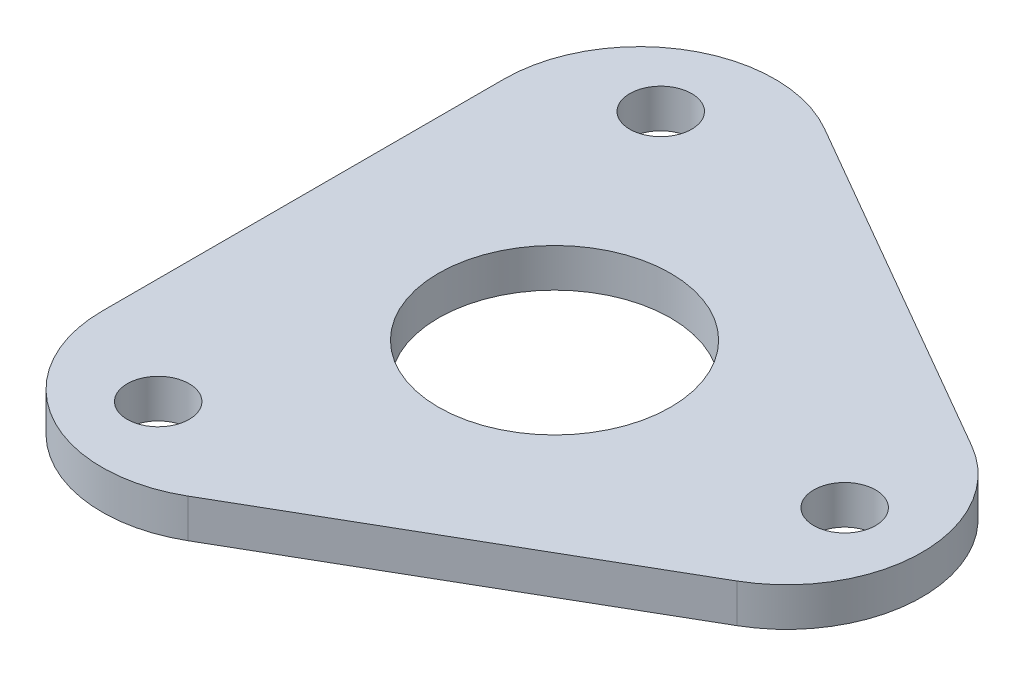
ISO-10303-21;
HEADER;
FILE_DESCRIPTION(('STEP AP214'),'2;1');
FILE_NAME('part.step','',(''),(''),'','','');
FILE_SCHEMA(('AUTOMOTIVE_DESIGN { 1 0 10303 214 1 1 1 1 }'));
ENDSEC;
DATA;
#1=APPLICATION_CONTEXT('core data for automotive mechanical design processes');
#2=APPLICATION_PROTOCOL_DEFINITION('international standard','automotive_design',2000,#1);
#3=PRODUCT_CONTEXT('',#1,'mechanical');
#4=PRODUCT('Part','Part','',(#3));
#5=PRODUCT_RELATED_PRODUCT_CATEGORY('part','',(#4));
#6=PRODUCT_DEFINITION_FORMATION('','',#4);
#7=PRODUCT_DEFINITION_CONTEXT('part definition',#1,'design');
#8=PRODUCT_DEFINITION('design','',#6,#7);
#9=PRODUCT_DEFINITION_SHAPE('','',#8);
#10=(LENGTH_UNIT() NAMED_UNIT(*) SI_UNIT(.MILLI.,.METRE.));
#11=(NAMED_UNIT(*) PLANE_ANGLE_UNIT() SI_UNIT($,.RADIAN.));
#12=(NAMED_UNIT(*) SI_UNIT($,.STERADIAN.) SOLID_ANGLE_UNIT());
#13=UNCERTAINTY_MEASURE_WITH_UNIT(LENGTH_MEASURE(1.E-05),#10,'distance_accuracy_value','');
#14=(GEOMETRIC_REPRESENTATION_CONTEXT(3) GLOBAL_UNCERTAINTY_ASSIGNED_CONTEXT((#13)) GLOBAL_UNIT_ASSIGNED_CONTEXT((#10,
#11,#12)) REPRESENTATION_CONTEXT('',''));
#15=CARTESIAN_POINT('',(0.,0.,0.));
#16=DIRECTION('',(0.,0.,1.));
#17=DIRECTION('',(1.,0.,0.));
#18=AXIS2_PLACEMENT_3D('',#15,#16,#17);
#19=CARTESIAN_POINT('',(0.,2.00000000000006,0.));
#20=DIRECTION('',(0.,1.,0.));
#21=DIRECTION('',(0.,0.,1.));
#22=AXIS2_PLACEMENT_3D('',#19,#20,#21);
#23=PLANE('',#22);
#24=CARTESIAN_POINT('',(15.0000000000004,2.00000000000006,-6.28837260041593E-13));
#25=DIRECTION('',(0.,1.,0.));
#26=DIRECTION('',(0.,0.,1.));
#27=AXIS2_PLACEMENT_3D('',#24,#25,#26);
#28=CIRCLE('',#27,1.60000000000077);
#29=CARTESIAN_POINT('',(15.0000000000004,2.00000000000006,1.60000000000014));
#30=VERTEX_POINT('',#29);
#31=EDGE_CURVE('E158',#30,#30,#28,.T.);
#32=ORIENTED_EDGE('',*,*,#31,.F.);
#33=EDGE_LOOP('',(#32));
#34=FACE_BOUND('',#33,.T.);
#35=CARTESIAN_POINT('',(-7.5,2.00000000000006,-12.9903810567666));
#36=DIRECTION('',(0.,1.,0.));
#37=DIRECTION('',(0.,0.,1.));
#38=AXIS2_PLACEMENT_3D('',#35,#36,#37);
#39=CIRCLE('',#38,1.6);
#40=CARTESIAN_POINT('',(-7.5,2.00000000000006,-11.3903810567666));
#41=VERTEX_POINT('',#40);
#42=EDGE_CURVE('E146',#41,#41,#39,.T.);
#43=ORIENTED_EDGE('',*,*,#42,.F.);
#44=EDGE_LOOP('',(#43));
#45=FACE_BOUND('',#44,.T.);
#46=DIRECTION('',(-0.86602540378444,0.,-0.499999999999998));
#47=VECTOR('',#46,1.);
#48=CARTESIAN_POINT('',(26.,2.00000000000006,0.));
#49=LINE('',#48,#47);
#50=CARTESIAN_POINT('',(15.5,2.00000000000006,-6.06217782649103));
#51=VERTEX_POINT('',#50);
#52=CARTESIAN_POINT('',(-2.50000000000003,2.00000000000006,-16.4544826719043));
#53=VERTEX_POINT('',#52);
#54=EDGE_CURVE('E121',#51,#53,#49,.T.);
#55=ORIENTED_EDGE('',*,*,#54,.T.);
#56=CARTESIAN_POINT('',(-6.00000000000002,2.00000000000006,-10.3923048454132));
#57=DIRECTION('',(0.,1.,0.));
#58=DIRECTION('',(0.,0.,1.));
#59=AXIS2_PLACEMENT_3D('',#56,#57,#58);
#60=CIRCLE('',#59,7.);
#61=CARTESIAN_POINT('',(-13.,2.00000000000006,-10.3923048454131));
#62=VERTEX_POINT('',#61);
#63=EDGE_CURVE('E136',#53,#62,#60,.T.);
#64=ORIENTED_EDGE('',*,*,#63,.T.);
#65=DIRECTION('',(0.,0.,1.));
#66=VECTOR('',#65,1.);
#67=CARTESIAN_POINT('',(-13.0000000000001,2.,-22.5166604983953));
#68=LINE('',#67,#66);
#69=CARTESIAN_POINT('',(-12.9999999999999,2.00000000000006,10.3923048454134));
#70=VERTEX_POINT('',#69);
#71=EDGE_CURVE('E111',#62,#70,#68,.T.);
#72=ORIENTED_EDGE('',*,*,#71,.T.);
#73=CARTESIAN_POINT('',(-5.99999999999987,2.,10.3923048454134));
#74=DIRECTION('',(0.,1.,0.));
#75=DIRECTION('',(0.,0.,1.));
#76=AXIS2_PLACEMENT_3D('',#73,#74,#75);
#77=CIRCLE('',#76,7.);
#78=CARTESIAN_POINT('',(-2.49999999999985,2.,16.4544826719044));
#79=VERTEX_POINT('',#78);
#80=EDGE_CURVE('E59',#70,#79,#77,.T.);
#81=ORIENTED_EDGE('',*,*,#80,.T.);
#82=DIRECTION('',(0.866025403784437,0.,-0.500000000000004));
#83=VECTOR('',#82,1.);
#84=CARTESIAN_POINT('',(-12.9999999999998,2.,22.5166604983955));
#85=LINE('',#84,#83);
#86=CARTESIAN_POINT('',(15.5000000000001,2.00000000000006,6.06217782649111));
#87=VERTEX_POINT('',#86);
#88=EDGE_CURVE('E118',#79,#87,#85,.T.);
#89=ORIENTED_EDGE('',*,*,#88,.T.);
#90=CARTESIAN_POINT('',(12.,2.,0.));
#91=DIRECTION('',(0.,1.,0.));
#92=DIRECTION('',(0.,0.,1.));
#93=AXIS2_PLACEMENT_3D('',#90,#91,#92);
#94=CIRCLE('',#93,7.);
#95=EDGE_CURVE('E133',#87,#51,#94,.T.);
#96=ORIENTED_EDGE('',*,*,#95,.T.);
#97=EDGE_LOOP('',(#55,#64,#72,#81,#89,#96));
#98=FACE_BOUND('',#97,.T.);
#99=CARTESIAN_POINT('',(0.,2.00000000000006,0.));
#100=DIRECTION('',(0.,1.,0.));
#101=DIRECTION('',(0.,0.,1.));
#102=AXIS2_PLACEMENT_3D('',#99,#100,#101);
#103=CIRCLE('',#102,6.);
#104=CARTESIAN_POINT('',(0.,2.00000000000006,6.));
#105=VERTEX_POINT('',#104);
#106=EDGE_CURVE('E153',#105,#105,#103,.T.);
#107=ORIENTED_EDGE('',*,*,#106,.F.);
#108=EDGE_LOOP('',(#107));
#109=FACE_BOUND('',#108,.T.);
#110=CARTESIAN_POINT('',(-7.49999999999927,2.,12.9903810567666));
#111=DIRECTION('',(0.,1.,0.));
#112=DIRECTION('',(0.,0.,1.));
#113=AXIS2_PLACEMENT_3D('',#110,#111,#112);
#114=CIRCLE('',#113,1.60000000000068);
#115=CARTESIAN_POINT('',(-7.49999999999927,2.,14.5903810567673));
#116=VERTEX_POINT('',#115);
#117=EDGE_CURVE('E164',#116,#116,#114,.T.);
#118=ORIENTED_EDGE('',*,*,#117,.F.);
#119=EDGE_LOOP('',(#118));
#120=FACE_BOUND('',#119,.T.);
#121=ADVANCED_FACE('F38',(#34,#45,#98,#109,#120),#23,.T.);
#122=CARTESIAN_POINT('',(0.,0.,0.));
#123=DIRECTION('',(0.,1.,0.));
#124=DIRECTION('',(0.,0.,1.));
#125=AXIS2_PLACEMENT_3D('',#122,#123,#124);
#126=PLANE('',#125);
#127=DIRECTION('',(0.,0.,1.));
#128=VECTOR('',#127,1.);
#129=CARTESIAN_POINT('',(-13.0000000000001,0.,-22.5166604983953));
#130=LINE('',#129,#128);
#131=CARTESIAN_POINT('',(-13.,0.,-10.3923048454131));
#132=VERTEX_POINT('',#131);
#133=CARTESIAN_POINT('',(-12.9999999999999,0.,10.3923048454134));
#134=VERTEX_POINT('',#133);
#135=EDGE_CURVE('E109',#132,#134,#130,.T.);
#136=ORIENTED_EDGE('',*,*,#135,.F.);
#137=CARTESIAN_POINT('',(-6.00000000000002,0.,-10.3923048454132));
#138=DIRECTION('',(0.,1.,0.));
#139=DIRECTION('',(0.,0.,1.));
#140=AXIS2_PLACEMENT_3D('',#137,#138,#139);
#141=CIRCLE('',#140,7.);
#142=CARTESIAN_POINT('',(-2.50000000000003,0.,-16.4544826719043));
#143=VERTEX_POINT('',#142);
#144=EDGE_CURVE('E92',#132,#143,#141,.F.);
#145=ORIENTED_EDGE('',*,*,#144,.T.);
#146=DIRECTION('',(-0.86602540378444,0.,-0.499999999999998));
#147=VECTOR('',#146,1.);
#148=CARTESIAN_POINT('',(26.,0.,0.));
#149=LINE('',#148,#147);
#150=CARTESIAN_POINT('',(15.5,0.,-6.06217782649103));
#151=VERTEX_POINT('',#150);
#152=EDGE_CURVE('E119',#151,#143,#149,.T.);
#153=ORIENTED_EDGE('',*,*,#152,.F.);
#154=CARTESIAN_POINT('',(12.,0.,0.));
#155=DIRECTION('',(0.,1.,0.));
#156=DIRECTION('',(0.,0.,1.));
#157=AXIS2_PLACEMENT_3D('',#154,#155,#156);
#158=CIRCLE('',#157,7.);
#159=CARTESIAN_POINT('',(15.5000000000001,0.,6.0621778264911));
#160=VERTEX_POINT('',#159);
#161=EDGE_CURVE('E112',#151,#160,#158,.F.);
#162=ORIENTED_EDGE('',*,*,#161,.T.);
#163=DIRECTION('',(0.866025403784437,0.,-0.500000000000004));
#164=VECTOR('',#163,1.);
#165=CARTESIAN_POINT('',(-12.9999999999998,0.,22.5166604983955));
#166=LINE('',#165,#164);
#167=CARTESIAN_POINT('',(-2.49999999999985,0.,16.4544826719044));
#168=VERTEX_POINT('',#167);
#169=EDGE_CURVE('E123',#168,#160,#166,.T.);
#170=ORIENTED_EDGE('',*,*,#169,.F.);
#171=CARTESIAN_POINT('',(-5.99999999999987,0.,10.3923048454134));
#172=DIRECTION('',(0.,1.,0.));
#173=DIRECTION('',(0.,0.,1.));
#174=AXIS2_PLACEMENT_3D('',#171,#172,#173);
#175=CIRCLE('',#174,7.);
#176=EDGE_CURVE('E103',#168,#134,#175,.F.);
#177=ORIENTED_EDGE('',*,*,#176,.T.);
#178=EDGE_LOOP('',(#136,#145,#153,#162,#170,#177));
#179=FACE_BOUND('',#178,.T.);
#180=CARTESIAN_POINT('',(-7.5,0.,-12.9903810567666));
#181=DIRECTION('',(0.,1.,0.));
#182=DIRECTION('',(0.,0.,1.));
#183=AXIS2_PLACEMENT_3D('',#180,#181,#182);
#184=CIRCLE('',#183,1.6);
#185=CARTESIAN_POINT('',(-7.5,0.,-11.3903810567666));
#186=VERTEX_POINT('',#185);
#187=EDGE_CURVE('E148',#186,#186,#184,.T.);
#188=ORIENTED_EDGE('',*,*,#187,.T.);
#189=EDGE_LOOP('',(#188));
#190=FACE_BOUND('',#189,.T.);
#191=CARTESIAN_POINT('',(0.,0.,0.));
#192=DIRECTION('',(0.,1.,0.));
#193=DIRECTION('',(0.,0.,1.));
#194=AXIS2_PLACEMENT_3D('',#191,#192,#193);
#195=CIRCLE('',#194,6.);
#196=CARTESIAN_POINT('',(0.,0.,6.));
#197=VERTEX_POINT('',#196);
#198=EDGE_CURVE('E155',#197,#197,#195,.T.);
#199=ORIENTED_EDGE('',*,*,#198,.T.);
#200=EDGE_LOOP('',(#199));
#201=FACE_BOUND('',#200,.T.);
#202=CARTESIAN_POINT('',(15.0000000000004,0.,-6.27969898303604E-13));
#203=DIRECTION('',(0.,1.,0.));
#204=DIRECTION('',(0.,0.,1.));
#205=AXIS2_PLACEMENT_3D('',#202,#203,#204);
#206=CIRCLE('',#205,1.60000000000077);
#207=CARTESIAN_POINT('',(15.0000000000004,0.,1.60000000000014));
#208=VERTEX_POINT('',#207);
#209=EDGE_CURVE('E161',#208,#208,#206,.T.);
#210=ORIENTED_EDGE('',*,*,#209,.T.);
#211=EDGE_LOOP('',(#210));
#212=FACE_BOUND('',#211,.T.);
#213=CARTESIAN_POINT('',(-7.49999999999927,0.,12.9903810567666));
#214=DIRECTION('',(0.,1.,0.));
#215=DIRECTION('',(0.,0.,1.));
#216=AXIS2_PLACEMENT_3D('',#213,#214,#215);
#217=CIRCLE('',#216,1.60000000000068);
#218=CARTESIAN_POINT('',(-7.49999999999927,0.,14.5903810567673));
#219=VERTEX_POINT('',#218);
#220=EDGE_CURVE('E167',#219,#219,#217,.T.);
#221=ORIENTED_EDGE('',*,*,#220,.T.);
#222=EDGE_LOOP('',(#221));
#223=FACE_BOUND('',#222,.T.);
#224=ADVANCED_FACE('F115',(#179,#190,#201,#212,#223),#126,.F.);
#225=CARTESIAN_POINT('',(-12.9999999999998,2.,22.5166604983955));
#226=DIRECTION('',(-0.500000000000004,0.,-0.866025403784436));
#227=DIRECTION('',(-0.866025403784437,0.,0.500000000000004));
#228=AXIS2_PLACEMENT_3D('',#225,#226,#227);
#229=PLANE('',#228);
#230=ORIENTED_EDGE('',*,*,#88,.F.);
#231=DIRECTION('',(0.,-1.,0.));
#232=VECTOR('',#231,1.);
#233=CARTESIAN_POINT('',(-2.49999999999985,2.,16.4544826719044));
#234=LINE('',#233,#232);
#235=EDGE_CURVE('E11',#79,#168,#234,.T.);
#236=ORIENTED_EDGE('',*,*,#235,.T.);
#237=ORIENTED_EDGE('',*,*,#169,.T.);
#238=DIRECTION('',(0.,-1.,0.));
#239=VECTOR('',#238,1.);
#240=CARTESIAN_POINT('',(15.5000000000001,2.00000000000006,6.06217782649111));
#241=LINE('',#240,#239);
#242=EDGE_CURVE('E46',#160,#87,#241,.F.);
#243=ORIENTED_EDGE('',*,*,#242,.T.);
#244=EDGE_LOOP('',(#230,#236,#237,#243));
#245=FACE_BOUND('',#244,.T.);
#246=ADVANCED_FACE('F182',(#245),#229,.F.);
#247=CARTESIAN_POINT('',(26.,2.00000000000006,0.));
#248=DIRECTION('',(-0.499999999999998,0.,0.86602540378444));
#249=DIRECTION('',(0.86602540378444,0.,0.499999999999998));
#250=AXIS2_PLACEMENT_3D('',#247,#248,#249);
#251=PLANE('',#250);
#252=ORIENTED_EDGE('',*,*,#152,.T.);
#253=DIRECTION('',(0.,-1.,0.));
#254=VECTOR('',#253,1.);
#255=CARTESIAN_POINT('',(-2.50000000000003,2.00000000000006,-16.4544826719043));
#256=LINE('',#255,#254);
#257=EDGE_CURVE('E97',#143,#53,#256,.F.);
#258=ORIENTED_EDGE('',*,*,#257,.T.);
#259=ORIENTED_EDGE('',*,*,#54,.F.);
#260=DIRECTION('',(0.,-1.,0.));
#261=VECTOR('',#260,1.);
#262=CARTESIAN_POINT('',(15.5,2.00000000000006,-6.06217782649103));
#263=LINE('',#262,#261);
#264=EDGE_CURVE('E102',#51,#151,#263,.T.);
#265=ORIENTED_EDGE('',*,*,#264,.T.);
#266=EDGE_LOOP('',(#252,#258,#259,#265));
#267=FACE_BOUND('',#266,.T.);
#268=ADVANCED_FACE('F192',(#267),#251,.F.);
#269=CARTESIAN_POINT('',(-13.0000000000001,2.,-22.5166604983953));
#270=DIRECTION('',(1.,0.,0.));
#271=DIRECTION('',(0.,0.,-1.));
#272=AXIS2_PLACEMENT_3D('',#269,#270,#271);
#273=PLANE('',#272);
#274=ORIENTED_EDGE('',*,*,#71,.F.);
#275=DIRECTION('',(0.,-1.,0.));
#276=VECTOR('',#275,1.);
#277=CARTESIAN_POINT('',(-13.,2.00000000000006,-10.3923048454131));
#278=LINE('',#277,#276);
#279=EDGE_CURVE('E96',#62,#132,#278,.T.);
#280=ORIENTED_EDGE('',*,*,#279,.T.);
#281=ORIENTED_EDGE('',*,*,#135,.T.);
#282=DIRECTION('',(0.,-1.,0.));
#283=VECTOR('',#282,1.);
#284=CARTESIAN_POINT('',(-12.9999999999999,2.00000000000006,10.3923048454134));
#285=LINE('',#284,#283);
#286=EDGE_CURVE('E113',#134,#70,#285,.F.);
#287=ORIENTED_EDGE('',*,*,#286,.T.);
#288=EDGE_LOOP('',(#274,#280,#281,#287));
#289=FACE_BOUND('',#288,.T.);
#290=ADVANCED_FACE('F108',(#289),#273,.F.);
#291=CARTESIAN_POINT('',(-7.5,2.00000000000006,-12.9903810567666));
#292=DIRECTION('',(0.,-1.,0.));
#293=DIRECTION('',(0.,0.,-1.));
#294=AXIS2_PLACEMENT_3D('',#291,#292,#293);
#295=CYLINDRICAL_SURFACE('',#294,1.6);
#296=ORIENTED_EDGE('',*,*,#42,.T.);
#297=EDGE_LOOP('',(#296));
#298=FACE_BOUND('',#297,.T.);
#299=ORIENTED_EDGE('',*,*,#187,.F.);
#300=EDGE_LOOP('',(#299));
#301=FACE_BOUND('',#300,.T.);
#302=ADVANCED_FACE('F187',(#298,#301),#295,.F.);
#303=CARTESIAN_POINT('',(0.,2.00000000000006,0.));
#304=DIRECTION('',(0.,-1.,0.));
#305=DIRECTION('',(0.,0.,-1.));
#306=AXIS2_PLACEMENT_3D('',#303,#304,#305);
#307=CYLINDRICAL_SURFACE('',#306,6.);
#308=ORIENTED_EDGE('',*,*,#106,.T.);
#309=EDGE_LOOP('',(#308));
#310=FACE_BOUND('',#309,.T.);
#311=ORIENTED_EDGE('',*,*,#198,.F.);
#312=EDGE_LOOP('',(#311));
#313=FACE_BOUND('',#312,.T.);
#314=ADVANCED_FACE('F228',(#310,#313),#307,.F.);
#315=CARTESIAN_POINT('',(15.0000000000004,2.00000000000006,-6.28837260041593E-13));
#316=DIRECTION('',(0.,-1.,0.));
#317=DIRECTION('',(0.,0.,-1.));
#318=AXIS2_PLACEMENT_3D('',#315,#316,#317);
#319=CYLINDRICAL_SURFACE('',#318,1.60000000000077);
#320=ORIENTED_EDGE('',*,*,#31,.T.);
#321=EDGE_LOOP('',(#320));
#322=FACE_BOUND('',#321,.T.);
#323=ORIENTED_EDGE('',*,*,#209,.F.);
#324=EDGE_LOOP('',(#323));
#325=FACE_BOUND('',#324,.T.);
#326=ADVANCED_FACE('F221',(#322,#325),#319,.F.);
#327=CARTESIAN_POINT('',(-7.49999999999927,2.,12.9903810567666));
#328=DIRECTION('',(0.,-1.,0.));
#329=DIRECTION('',(0.,0.,-1.));
#330=AXIS2_PLACEMENT_3D('',#327,#328,#329);
#331=CYLINDRICAL_SURFACE('',#330,1.60000000000068);
#332=ORIENTED_EDGE('',*,*,#117,.T.);
#333=EDGE_LOOP('',(#332));
#334=FACE_BOUND('',#333,.T.);
#335=ORIENTED_EDGE('',*,*,#220,.F.);
#336=EDGE_LOOP('',(#335));
#337=FACE_BOUND('',#336,.T.);
#338=ADVANCED_FACE('F173',(#334,#337),#331,.F.);
#339=CARTESIAN_POINT('',(-6.00000000000002,2.00000000000006,-10.3923048454132));
#340=DIRECTION('',(0.,-1.,0.));
#341=DIRECTION('',(0.,0.,-1.));
#342=AXIS2_PLACEMENT_3D('',#339,#340,#341);
#343=CYLINDRICAL_SURFACE('',#342,7.);
#344=ORIENTED_EDGE('',*,*,#63,.F.);
#345=ORIENTED_EDGE('',*,*,#257,.F.);
#346=ORIENTED_EDGE('',*,*,#144,.F.);
#347=ORIENTED_EDGE('',*,*,#279,.F.);
#348=EDGE_LOOP('',(#344,#345,#346,#347));
#349=FACE_BOUND('',#348,.T.);
#350=ADVANCED_FACE('F95',(#349),#343,.T.);
#351=CARTESIAN_POINT('',(-5.99999999999987,2.,10.3923048454134));
#352=DIRECTION('',(0.,-1.,0.));
#353=DIRECTION('',(0.,0.,-1.));
#354=AXIS2_PLACEMENT_3D('',#351,#352,#353);
#355=CYLINDRICAL_SURFACE('',#354,7.);
#356=ORIENTED_EDGE('',*,*,#80,.F.);
#357=ORIENTED_EDGE('',*,*,#286,.F.);
#358=ORIENTED_EDGE('',*,*,#176,.F.);
#359=ORIENTED_EDGE('',*,*,#235,.F.);
#360=EDGE_LOOP('',(#356,#357,#358,#359));
#361=FACE_BOUND('',#360,.T.);
#362=ADVANCED_FACE('F198',(#361),#355,.T.);
#363=CARTESIAN_POINT('',(12.,2.,0.));
#364=DIRECTION('',(0.,-1.,0.));
#365=DIRECTION('',(0.,0.,-1.));
#366=AXIS2_PLACEMENT_3D('',#363,#364,#365);
#367=CYLINDRICAL_SURFACE('',#366,7.);
#368=ORIENTED_EDGE('',*,*,#95,.F.);
#369=ORIENTED_EDGE('',*,*,#242,.F.);
#370=ORIENTED_EDGE('',*,*,#161,.F.);
#371=ORIENTED_EDGE('',*,*,#264,.F.);
#372=EDGE_LOOP('',(#368,#369,#370,#371));
#373=FACE_BOUND('',#372,.T.);
#374=ADVANCED_FACE('F40',(#373),#367,.T.);
#375=CLOSED_SHELL('',(#121,#224,#246,#268,#290,#302,#314,#326,#338,#350,#362,#374));
#376=MANIFOLD_SOLID_BREP('B2',#375);
#377=ADVANCED_BREP_SHAPE_REPRESENTATION('',(#18,#376),#14);
#378=SHAPE_DEFINITION_REPRESENTATION(#9,#377);
ENDSEC;
END-ISO-10303-21;
